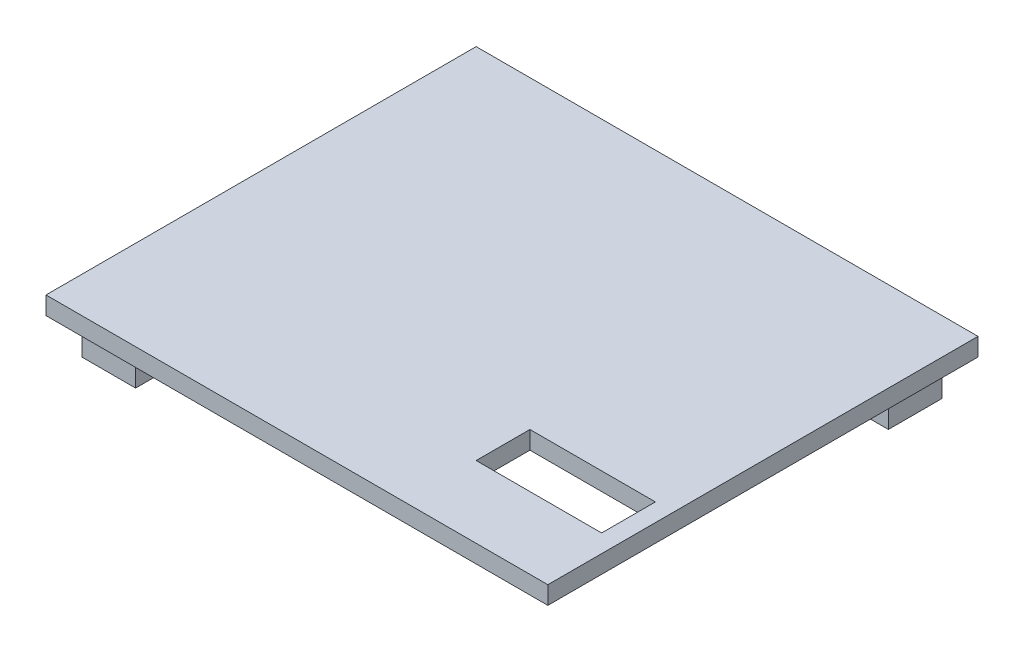
ISO-10303-21;
HEADER;
FILE_DESCRIPTION(('STEP AP214'),'2;1');
FILE_NAME('part.step','',(''),(''),'','','');
FILE_SCHEMA(('AUTOMOTIVE_DESIGN { 1 0 10303 214 1 1 1 1 }'));
ENDSEC;
DATA;
#1=APPLICATION_CONTEXT('core data for automotive mechanical design processes');
#2=APPLICATION_PROTOCOL_DEFINITION('international standard','automotive_design',2000,#1);
#3=PRODUCT_CONTEXT('',#1,'mechanical');
#4=PRODUCT('Part','Part','',(#3));
#5=PRODUCT_RELATED_PRODUCT_CATEGORY('part','',(#4));
#6=PRODUCT_DEFINITION_FORMATION('','',#4);
#7=PRODUCT_DEFINITION_CONTEXT('part definition',#1,'design');
#8=PRODUCT_DEFINITION('design','',#6,#7);
#9=PRODUCT_DEFINITION_SHAPE('','',#8);
#10=(LENGTH_UNIT() NAMED_UNIT(*) SI_UNIT(.MILLI.,.METRE.));
#11=(NAMED_UNIT(*) PLANE_ANGLE_UNIT() SI_UNIT($,.RADIAN.));
#12=(NAMED_UNIT(*) SI_UNIT($,.STERADIAN.) SOLID_ANGLE_UNIT());
#13=UNCERTAINTY_MEASURE_WITH_UNIT(LENGTH_MEASURE(1.E-05),#10,'distance_accuracy_value','');
#14=(GEOMETRIC_REPRESENTATION_CONTEXT(3) GLOBAL_UNCERTAINTY_ASSIGNED_CONTEXT((#13)) GLOBAL_UNIT_ASSIGNED_CONTEXT((#10,
#11,#12)) REPRESENTATION_CONTEXT('',''));
#15=CARTESIAN_POINT('',(0.,0.,0.));
#16=DIRECTION('',(0.,0.,1.));
#17=DIRECTION('',(1.,0.,0.));
#18=AXIS2_PLACEMENT_3D('',#15,#16,#17);
#19=CARTESIAN_POINT('',(0.,0.,0.));
#20=DIRECTION('',(0.,-1.,0.));
#21=DIRECTION('',(0.,0.,-1.));
#22=AXIS2_PLACEMENT_3D('',#19,#20,#21);
#23=PLANE('',#22);
#24=DIRECTION('',(-1.,0.,0.));
#25=VECTOR('',#24,1.);
#26=CARTESIAN_POINT('',(0.,0.,-146.05));
#27=LINE('',#26,#25);
#28=CARTESIAN_POINT('',(-152.4,0.,-146.05));
#29=VERTEX_POINT('',#28);
#30=CARTESIAN_POINT('',(-171.45,0.,-146.05));
#31=VERTEX_POINT('',#30);
#32=EDGE_CURVE('E213',#29,#31,#27,.T.);
#33=ORIENTED_EDGE('',*,*,#32,.T.);
#34=DIRECTION('',(0.,0.,1.));
#35=VECTOR('',#34,1.);
#36=CARTESIAN_POINT('',(-171.45,0.,0.));
#37=LINE('',#36,#35);
#38=CARTESIAN_POINT('',(-171.45,0.,-127.));
#39=VERTEX_POINT('',#38);
#40=EDGE_CURVE('E228',#31,#39,#37,.T.);
#41=ORIENTED_EDGE('',*,*,#40,.T.);
#42=DIRECTION('',(1.,0.,0.));
#43=VECTOR('',#42,1.);
#44=CARTESIAN_POINT('',(0.,0.,-127.));
#45=LINE('',#44,#43);
#46=CARTESIAN_POINT('',(-165.1,0.,-127.));
#47=VERTEX_POINT('',#46);
#48=EDGE_CURVE('E248',#39,#47,#45,.T.);
#49=ORIENTED_EDGE('',*,*,#48,.T.);
#50=DIRECTION('',(0.,0.,-1.));
#51=VECTOR('',#50,1.);
#52=CARTESIAN_POINT('',(-165.1,0.,0.));
#53=LINE('',#52,#51);
#54=CARTESIAN_POINT('',(-165.1,0.,-139.720102982205));
#55=VERTEX_POINT('',#54);
#56=EDGE_CURVE('E246',#47,#55,#53,.T.);
#57=ORIENTED_EDGE('',*,*,#56,.T.);
#58=DIRECTION('',(1.,0.,0.));
#59=VECTOR('',#58,1.);
#60=CARTESIAN_POINT('',(0.,0.,-139.720102982205));
#61=LINE('',#60,#59);
#62=CARTESIAN_POINT('',(-152.4,0.,-139.720102982205));
#63=VERTEX_POINT('',#62);
#64=EDGE_CURVE('E55',#55,#63,#61,.T.);
#65=ORIENTED_EDGE('',*,*,#64,.T.);
#66=DIRECTION('',(0.,0.,-1.));
#67=VECTOR('',#66,1.);
#68=CARTESIAN_POINT('',(-152.4,0.,0.));
#69=LINE('',#68,#67);
#70=EDGE_CURVE('E50',#63,#29,#69,.T.);
#71=ORIENTED_EDGE('',*,*,#70,.T.);
#72=EDGE_LOOP('',(#33,#41,#49,#57,#65,#71));
#73=FACE_BOUND('',#72,.T.);
#74=DIRECTION('',(1.,0.,0.));
#75=VECTOR('',#74,1.);
#76=CARTESIAN_POINT('',(0.,0.,0.));
#77=LINE('',#76,#75);
#78=CARTESIAN_POINT('',(-177.8,0.,0.));
#79=VERTEX_POINT('',#78);
#80=CARTESIAN_POINT('',(0.,0.,0.));
#81=VERTEX_POINT('',#80);
#82=EDGE_CURVE('E384',#79,#81,#77,.T.);
#83=ORIENTED_EDGE('',*,*,#82,.F.);
#84=DIRECTION('',(0.,0.,1.));
#85=VECTOR('',#84,1.);
#86=CARTESIAN_POINT('',(-177.8,0.,0.));
#87=LINE('',#86,#85);
#88=CARTESIAN_POINT('',(-177.8,0.,-152.4));
#89=VERTEX_POINT('',#88);
#90=EDGE_CURVE('E389',#89,#79,#87,.T.);
#91=ORIENTED_EDGE('',*,*,#90,.F.);
#92=DIRECTION('',(-1.,0.,0.));
#93=VECTOR('',#92,1.);
#94=CARTESIAN_POINT('',(0.,0.,-152.4));
#95=LINE('',#94,#93);
#96=CARTESIAN_POINT('',(0.,0.,-152.4));
#97=VERTEX_POINT('',#96);
#98=EDGE_CURVE('E400',#97,#89,#95,.T.);
#99=ORIENTED_EDGE('',*,*,#98,.F.);
#100=DIRECTION('',(0.,0.,-1.));
#101=VECTOR('',#100,1.);
#102=CARTESIAN_POINT('',(0.,0.,0.));
#103=LINE('',#102,#101);
#104=EDGE_CURVE('E398',#81,#97,#103,.T.);
#105=ORIENTED_EDGE('',*,*,#104,.F.);
#106=EDGE_LOOP('',(#83,#91,#99,#105));
#107=FACE_BOUND('',#106,.T.);
#108=DIRECTION('',(1.,0.,0.));
#109=VECTOR('',#108,1.);
#110=CARTESIAN_POINT('',(-6.35,0.,-25.4));
#111=LINE('',#110,#109);
#112=CARTESIAN_POINT('',(-50.8,0.,-25.4));
#113=VERTEX_POINT('',#112);
#114=CARTESIAN_POINT('',(-6.35,0.,-25.4));
#115=VERTEX_POINT('',#114);
#116=EDGE_CURVE('E357',#113,#115,#111,.T.);
#117=ORIENTED_EDGE('',*,*,#116,.T.);
#118=DIRECTION('',(0.,0.,-1.));
#119=VECTOR('',#118,1.);
#120=CARTESIAN_POINT('',(-6.35,0.,-44.45));
#121=LINE('',#120,#119);
#122=CARTESIAN_POINT('',(-6.35,0.,-44.45));
#123=VERTEX_POINT('',#122);
#124=EDGE_CURVE('E353',#115,#123,#121,.T.);
#125=ORIENTED_EDGE('',*,*,#124,.T.);
#126=DIRECTION('',(-1.,0.,0.));
#127=VECTOR('',#126,1.);
#128=CARTESIAN_POINT('',(-50.8,0.,-44.45));
#129=LINE('',#128,#127);
#130=CARTESIAN_POINT('',(-50.8,0.,-44.45));
#131=VERTEX_POINT('',#130);
#132=EDGE_CURVE('E367',#123,#131,#129,.T.);
#133=ORIENTED_EDGE('',*,*,#132,.T.);
#134=DIRECTION('',(0.,0.,1.));
#135=VECTOR('',#134,1.);
#136=CARTESIAN_POINT('',(-50.8,0.,-25.4));
#137=LINE('',#136,#135);
#138=EDGE_CURVE('E370',#131,#113,#137,.T.);
#139=ORIENTED_EDGE('',*,*,#138,.T.);
#140=EDGE_LOOP('',(#117,#125,#133,#139));
#141=FACE_BOUND('',#140,.T.);
#142=DIRECTION('',(1.,0.,0.));
#143=VECTOR('',#142,1.);
#144=CARTESIAN_POINT('',(0.,0.,-12.7));
#145=LINE('',#144,#143);
#146=CARTESIAN_POINT('',(-165.1,0.,-12.7));
#147=VERTEX_POINT('',#146);
#148=CARTESIAN_POINT('',(-152.4,0.,-12.7));
#149=VERTEX_POINT('',#148);
#150=EDGE_CURVE('E327',#147,#149,#145,.T.);
#151=ORIENTED_EDGE('',*,*,#150,.F.);
#152=DIRECTION('',(0.,0.,1.));
#153=VECTOR('',#152,1.);
#154=CARTESIAN_POINT('',(-165.1,0.,0.));
#155=LINE('',#154,#153);
#156=CARTESIAN_POINT('',(-165.1,0.,-25.4));
#157=VERTEX_POINT('',#156);
#158=EDGE_CURVE('E306',#157,#147,#155,.T.);
#159=ORIENTED_EDGE('',*,*,#158,.F.);
#160=DIRECTION('',(1.,0.,0.));
#161=VECTOR('',#160,1.);
#162=CARTESIAN_POINT('',(0.,0.,-25.4));
#163=LINE('',#162,#161);
#164=CARTESIAN_POINT('',(-171.45,0.,-25.4));
#165=VERTEX_POINT('',#164);
#166=EDGE_CURVE('E311',#165,#157,#163,.T.);
#167=ORIENTED_EDGE('',*,*,#166,.F.);
#168=DIRECTION('',(0.,0.,1.));
#169=VECTOR('',#168,1.);
#170=CARTESIAN_POINT('',(-171.45,0.,0.));
#171=LINE('',#170,#169);
#172=CARTESIAN_POINT('',(-171.45,0.,-6.34999999999999));
#173=VERTEX_POINT('',#172);
#174=EDGE_CURVE('E336',#165,#173,#171,.T.);
#175=ORIENTED_EDGE('',*,*,#174,.T.);
#176=DIRECTION('',(1.,0.,0.));
#177=VECTOR('',#176,1.);
#178=CARTESIAN_POINT('',(0.,0.,-6.34999999999999));
#179=LINE('',#178,#177);
#180=CARTESIAN_POINT('',(-152.4,0.,-6.34999999999999));
#181=VERTEX_POINT('',#180);
#182=EDGE_CURVE('E333',#173,#181,#179,.T.);
#183=ORIENTED_EDGE('',*,*,#182,.T.);
#184=DIRECTION('',(0.,0.,-1.));
#185=VECTOR('',#184,1.);
#186=CARTESIAN_POINT('',(-152.4,0.,0.));
#187=LINE('',#186,#185);
#188=EDGE_CURVE('E330',#181,#149,#187,.T.);
#189=ORIENTED_EDGE('',*,*,#188,.T.);
#190=EDGE_LOOP('',(#151,#159,#167,#175,#183,#189));
#191=FACE_BOUND('',#190,.T.);
#192=DIRECTION('',(0.,0.,-1.));
#193=VECTOR('',#192,1.);
#194=CARTESIAN_POINT('',(-25.4,0.,0.));
#195=LINE('',#194,#193);
#196=CARTESIAN_POINT('',(-25.4,0.,-139.720102982205));
#197=VERTEX_POINT('',#196);
#198=CARTESIAN_POINT('',(-25.4,0.,-146.05));
#199=VERTEX_POINT('',#198);
#200=EDGE_CURVE('E281',#197,#199,#195,.T.);
#201=ORIENTED_EDGE('',*,*,#200,.F.);
#202=DIRECTION('',(-1.,0.,0.));
#203=VECTOR('',#202,1.);
#204=CARTESIAN_POINT('',(0.,0.,-139.720102982205));
#205=LINE('',#204,#203);
#206=CARTESIAN_POINT('',(-12.7,0.,-139.720102982205));
#207=VERTEX_POINT('',#206);
#208=EDGE_CURVE('E216',#207,#197,#205,.T.);
#209=ORIENTED_EDGE('',*,*,#208,.F.);
#210=DIRECTION('',(0.,0.,-1.));
#211=VECTOR('',#210,1.);
#212=CARTESIAN_POINT('',(-12.7,0.,0.));
#213=LINE('',#212,#211);
#214=CARTESIAN_POINT('',(-12.7,0.,-127.));
#215=VERTEX_POINT('',#214);
#216=EDGE_CURVE('E266',#215,#207,#213,.T.);
#217=ORIENTED_EDGE('',*,*,#216,.F.);
#218=DIRECTION('',(-1.,0.,0.));
#219=VECTOR('',#218,1.);
#220=CARTESIAN_POINT('',(0.,0.,-127.));
#221=LINE('',#220,#219);
#222=CARTESIAN_POINT('',(-6.34999999999999,0.,-127.));
#223=VERTEX_POINT('',#222);
#224=EDGE_CURVE('E290',#223,#215,#221,.T.);
#225=ORIENTED_EDGE('',*,*,#224,.F.);
#226=DIRECTION('',(0.,0.,-1.));
#227=VECTOR('',#226,1.);
#228=CARTESIAN_POINT('',(-6.34999999999999,0.,0.));
#229=LINE('',#228,#227);
#230=CARTESIAN_POINT('',(-6.34999999999999,0.,-146.05));
#231=VERTEX_POINT('',#230);
#232=EDGE_CURVE('E287',#223,#231,#229,.T.);
#233=ORIENTED_EDGE('',*,*,#232,.T.);
#234=DIRECTION('',(-1.,0.,0.));
#235=VECTOR('',#234,1.);
#236=CARTESIAN_POINT('',(0.,0.,-146.05));
#237=LINE('',#236,#235);
#238=EDGE_CURVE('E284',#231,#199,#237,.T.);
#239=ORIENTED_EDGE('',*,*,#238,.T.);
#240=EDGE_LOOP('',(#201,#209,#217,#225,#233,#239));
#241=FACE_BOUND('',#240,.T.);
#242=ADVANCED_FACE('F35',(#73,#107,#141,#191,#241),#23,.T.);
#243=CARTESIAN_POINT('',(0.,6.35,0.));
#244=DIRECTION('',(0.,-1.,0.));
#245=DIRECTION('',(0.,0.,-1.));
#246=AXIS2_PLACEMENT_3D('',#243,#244,#245);
#247=PLANE('',#246);
#248=DIRECTION('',(1.,0.,0.));
#249=VECTOR('',#248,1.);
#250=CARTESIAN_POINT('',(0.,6.35,0.));
#251=LINE('',#250,#249);
#252=CARTESIAN_POINT('',(-177.8,6.35,0.));
#253=VERTEX_POINT('',#252);
#254=CARTESIAN_POINT('',(0.,6.35,0.));
#255=VERTEX_POINT('',#254);
#256=EDGE_CURVE('E385',#253,#255,#251,.T.);
#257=ORIENTED_EDGE('',*,*,#256,.T.);
#258=DIRECTION('',(0.,0.,-1.));
#259=VECTOR('',#258,1.);
#260=CARTESIAN_POINT('',(0.,6.35,0.));
#261=LINE('',#260,#259);
#262=CARTESIAN_POINT('',(0.,6.35,-152.4));
#263=VERTEX_POINT('',#262);
#264=EDGE_CURVE('E388',#255,#263,#261,.T.);
#265=ORIENTED_EDGE('',*,*,#264,.T.);
#266=DIRECTION('',(-1.,0.,0.));
#267=VECTOR('',#266,1.);
#268=CARTESIAN_POINT('',(0.,6.35,-152.4));
#269=LINE('',#268,#267);
#270=CARTESIAN_POINT('',(-177.8,6.35,-152.4));
#271=VERTEX_POINT('',#270);
#272=EDGE_CURVE('E391',#263,#271,#269,.T.);
#273=ORIENTED_EDGE('',*,*,#272,.T.);
#274=DIRECTION('',(0.,0.,1.));
#275=VECTOR('',#274,1.);
#276=CARTESIAN_POINT('',(-177.8,6.35,0.));
#277=LINE('',#276,#275);
#278=EDGE_CURVE('E393',#271,#253,#277,.T.);
#279=ORIENTED_EDGE('',*,*,#278,.T.);
#280=EDGE_LOOP('',(#257,#265,#273,#279));
#281=FACE_BOUND('',#280,.T.);
#282=DIRECTION('',(0.,0.,-1.));
#283=VECTOR('',#282,1.);
#284=CARTESIAN_POINT('',(-6.35,6.35,-44.45));
#285=LINE('',#284,#283);
#286=CARTESIAN_POINT('',(-6.35,6.35,-25.4));
#287=VERTEX_POINT('',#286);
#288=CARTESIAN_POINT('',(-6.35,6.35,-44.45));
#289=VERTEX_POINT('',#288);
#290=EDGE_CURVE('E354',#287,#289,#285,.T.);
#291=ORIENTED_EDGE('',*,*,#290,.F.);
#292=DIRECTION('',(1.,0.,0.));
#293=VECTOR('',#292,1.);
#294=CARTESIAN_POINT('',(-6.35,6.35,-25.4));
#295=LINE('',#294,#293);
#296=CARTESIAN_POINT('',(-50.8,6.35,-25.4));
#297=VERTEX_POINT('',#296);
#298=EDGE_CURVE('E362',#297,#287,#295,.T.);
#299=ORIENTED_EDGE('',*,*,#298,.F.);
#300=DIRECTION('',(0.,0.,1.));
#301=VECTOR('',#300,1.);
#302=CARTESIAN_POINT('',(-50.8,6.35,-25.4));
#303=LINE('',#302,#301);
#304=CARTESIAN_POINT('',(-50.8,6.35,-44.45));
#305=VERTEX_POINT('',#304);
#306=EDGE_CURVE('E359',#305,#297,#303,.T.);
#307=ORIENTED_EDGE('',*,*,#306,.F.);
#308=DIRECTION('',(-1.,0.,0.));
#309=VECTOR('',#308,1.);
#310=CARTESIAN_POINT('',(-50.8,6.35,-44.45));
#311=LINE('',#310,#309);
#312=EDGE_CURVE('E356',#289,#305,#311,.T.);
#313=ORIENTED_EDGE('',*,*,#312,.F.);
#314=EDGE_LOOP('',(#291,#299,#307,#313));
#315=FACE_BOUND('',#314,.T.);
#316=ADVANCED_FACE('F427',(#281,#315),#247,.F.);
#317=CARTESIAN_POINT('',(0.,6.35,0.));
#318=DIRECTION('',(0.,0.,-1.));
#319=DIRECTION('',(-1.,0.,0.));
#320=AXIS2_PLACEMENT_3D('',#317,#318,#319);
#321=PLANE('',#320);
#322=ORIENTED_EDGE('',*,*,#82,.T.);
#323=DIRECTION('',(0.,-1.,0.));
#324=VECTOR('',#323,1.);
#325=CARTESIAN_POINT('',(0.,6.35,0.));
#326=LINE('',#325,#324);
#327=EDGE_CURVE('E11',#255,#81,#326,.T.);
#328=ORIENTED_EDGE('',*,*,#327,.F.);
#329=ORIENTED_EDGE('',*,*,#256,.F.);
#330=DIRECTION('',(0.,-1.,0.));
#331=VECTOR('',#330,1.);
#332=CARTESIAN_POINT('',(-177.8,6.35,0.));
#333=LINE('',#332,#331);
#334=EDGE_CURVE('E395',#253,#79,#333,.T.);
#335=ORIENTED_EDGE('',*,*,#334,.T.);
#336=EDGE_LOOP('',(#322,#328,#329,#335));
#337=FACE_BOUND('',#336,.T.);
#338=ADVANCED_FACE('F37',(#337),#321,.F.);
#339=CARTESIAN_POINT('',(0.,6.35,0.));
#340=DIRECTION('',(-1.,0.,0.));
#341=DIRECTION('',(0.,0.,1.));
#342=AXIS2_PLACEMENT_3D('',#339,#340,#341);
#343=PLANE('',#342);
#344=ORIENTED_EDGE('',*,*,#104,.T.);
#345=DIRECTION('',(0.,-1.,0.));
#346=VECTOR('',#345,1.);
#347=CARTESIAN_POINT('',(0.,6.35,-152.4));
#348=LINE('',#347,#346);
#349=EDGE_CURVE('E43',#263,#97,#348,.T.);
#350=ORIENTED_EDGE('',*,*,#349,.F.);
#351=ORIENTED_EDGE('',*,*,#264,.F.);
#352=ORIENTED_EDGE('',*,*,#327,.T.);
#353=EDGE_LOOP('',(#344,#350,#351,#352));
#354=FACE_BOUND('',#353,.T.);
#355=ADVANCED_FACE('F429',(#354),#343,.F.);
#356=CARTESIAN_POINT('',(0.,6.35,-152.4));
#357=DIRECTION('',(0.,0.,1.));
#358=DIRECTION('',(1.,0.,0.));
#359=AXIS2_PLACEMENT_3D('',#356,#357,#358);
#360=PLANE('',#359);
#361=ORIENTED_EDGE('',*,*,#98,.T.);
#362=DIRECTION('',(0.,-1.,0.));
#363=VECTOR('',#362,1.);
#364=CARTESIAN_POINT('',(-177.8,6.35,-152.4));
#365=LINE('',#364,#363);
#366=EDGE_CURVE('E405',#271,#89,#365,.T.);
#367=ORIENTED_EDGE('',*,*,#366,.F.);
#368=ORIENTED_EDGE('',*,*,#272,.F.);
#369=ORIENTED_EDGE('',*,*,#349,.T.);
#370=EDGE_LOOP('',(#361,#367,#368,#369));
#371=FACE_BOUND('',#370,.T.);
#372=ADVANCED_FACE('F412',(#371),#360,.F.);
#373=CARTESIAN_POINT('',(-177.8,6.35,0.));
#374=DIRECTION('',(1.,0.,0.));
#375=DIRECTION('',(0.,0.,-1.));
#376=AXIS2_PLACEMENT_3D('',#373,#374,#375);
#377=PLANE('',#376);
#378=ORIENTED_EDGE('',*,*,#90,.T.);
#379=ORIENTED_EDGE('',*,*,#334,.F.);
#380=ORIENTED_EDGE('',*,*,#278,.F.);
#381=ORIENTED_EDGE('',*,*,#366,.T.);
#382=EDGE_LOOP('',(#378,#379,#380,#381));
#383=FACE_BOUND('',#382,.T.);
#384=ADVANCED_FACE('F421',(#383),#377,.F.);
#385=CARTESIAN_POINT('',(-6.35,6.35,-44.45));
#386=DIRECTION('',(-1.,0.,0.));
#387=DIRECTION('',(0.,0.,1.));
#388=AXIS2_PLACEMENT_3D('',#385,#386,#387);
#389=PLANE('',#388);
#390=ORIENTED_EDGE('',*,*,#124,.F.);
#391=DIRECTION('',(0.,-1.,0.));
#392=VECTOR('',#391,1.);
#393=CARTESIAN_POINT('',(-6.35,6.35,-25.4));
#394=LINE('',#393,#392);
#395=EDGE_CURVE('E364',#287,#115,#394,.T.);
#396=ORIENTED_EDGE('',*,*,#395,.F.);
#397=ORIENTED_EDGE('',*,*,#290,.T.);
#398=DIRECTION('',(0.,-1.,0.));
#399=VECTOR('',#398,1.);
#400=CARTESIAN_POINT('',(-6.35,6.35,-44.45));
#401=LINE('',#400,#399);
#402=EDGE_CURVE('E381',#289,#123,#401,.T.);
#403=ORIENTED_EDGE('',*,*,#402,.T.);
#404=EDGE_LOOP('',(#390,#396,#397,#403));
#405=FACE_BOUND('',#404,.T.);
#406=ADVANCED_FACE('F445',(#405),#389,.T.);
#407=CARTESIAN_POINT('',(-50.8,6.35,-44.45));
#408=DIRECTION('',(0.,0.,1.));
#409=DIRECTION('',(1.,0.,0.));
#410=AXIS2_PLACEMENT_3D('',#407,#408,#409);
#411=PLANE('',#410);
#412=ORIENTED_EDGE('',*,*,#132,.F.);
#413=ORIENTED_EDGE('',*,*,#402,.F.);
#414=ORIENTED_EDGE('',*,*,#312,.T.);
#415=DIRECTION('',(0.,-1.,0.));
#416=VECTOR('',#415,1.);
#417=CARTESIAN_POINT('',(-50.8,6.35,-44.45));
#418=LINE('',#417,#416);
#419=EDGE_CURVE('E379',#305,#131,#418,.T.);
#420=ORIENTED_EDGE('',*,*,#419,.T.);
#421=EDGE_LOOP('',(#412,#413,#414,#420));
#422=FACE_BOUND('',#421,.T.);
#423=ADVANCED_FACE('F449',(#422),#411,.T.);
#424=CARTESIAN_POINT('',(-50.8,6.35,-25.4));
#425=DIRECTION('',(1.,0.,0.));
#426=DIRECTION('',(0.,0.,-1.));
#427=AXIS2_PLACEMENT_3D('',#424,#425,#426);
#428=PLANE('',#427);
#429=ORIENTED_EDGE('',*,*,#138,.F.);
#430=ORIENTED_EDGE('',*,*,#419,.F.);
#431=ORIENTED_EDGE('',*,*,#306,.T.);
#432=DIRECTION('',(0.,-1.,0.));
#433=VECTOR('',#432,1.);
#434=CARTESIAN_POINT('',(-50.8,6.35,-25.4));
#435=LINE('',#434,#433);
#436=EDGE_CURVE('E377',#297,#113,#435,.T.);
#437=ORIENTED_EDGE('',*,*,#436,.T.);
#438=EDGE_LOOP('',(#429,#430,#431,#437));
#439=FACE_BOUND('',#438,.T.);
#440=ADVANCED_FACE('F454',(#439),#428,.T.);
#441=CARTESIAN_POINT('',(-6.35,6.35,-25.4));
#442=DIRECTION('',(0.,0.,-1.));
#443=DIRECTION('',(-1.,0.,0.));
#444=AXIS2_PLACEMENT_3D('',#441,#442,#443);
#445=PLANE('',#444);
#446=ORIENTED_EDGE('',*,*,#116,.F.);
#447=ORIENTED_EDGE('',*,*,#436,.F.);
#448=ORIENTED_EDGE('',*,*,#298,.T.);
#449=ORIENTED_EDGE('',*,*,#395,.T.);
#450=EDGE_LOOP('',(#446,#447,#448,#449));
#451=FACE_BOUND('',#450,.T.);
#452=ADVANCED_FACE('F460',(#451),#445,.T.);
#453=CARTESIAN_POINT('',(-165.1,-12.7,0.));
#454=DIRECTION('',(-1.,0.,0.));
#455=DIRECTION('',(0.,0.,1.));
#456=AXIS2_PLACEMENT_3D('',#453,#454,#455);
#457=PLANE('',#456);
#458=ORIENTED_EDGE('',*,*,#158,.T.);
#459=DIRECTION('',(0.,1.,0.));
#460=VECTOR('',#459,1.);
#461=CARTESIAN_POINT('',(-165.1,-12.7,-12.7));
#462=LINE('',#461,#460);
#463=CARTESIAN_POINT('',(-165.1,-12.7,-12.7));
#464=VERTEX_POINT('',#463);
#465=EDGE_CURVE('E351',#464,#147,#462,.T.);
#466=ORIENTED_EDGE('',*,*,#465,.F.);
#467=DIRECTION('',(0.,0.,1.));
#468=VECTOR('',#467,1.);
#469=CARTESIAN_POINT('',(-165.1,-12.7,0.));
#470=LINE('',#469,#468);
#471=CARTESIAN_POINT('',(-165.1,-12.7,-25.4));
#472=VERTEX_POINT('',#471);
#473=EDGE_CURVE('E307',#472,#464,#470,.T.);
#474=ORIENTED_EDGE('',*,*,#473,.F.);
#475=DIRECTION('',(0.,1.,0.));
#476=VECTOR('',#475,1.);
#477=CARTESIAN_POINT('',(-165.1,-12.7,-25.4));
#478=LINE('',#477,#476);
#479=EDGE_CURVE('E324',#472,#157,#478,.T.);
#480=ORIENTED_EDGE('',*,*,#479,.T.);
#481=EDGE_LOOP('',(#458,#466,#474,#480));
#482=FACE_BOUND('',#481,.T.);
#483=ADVANCED_FACE('F464',(#482),#457,.F.);
#484=CARTESIAN_POINT('',(0.,-12.7,-12.7));
#485=DIRECTION('',(0.,0.,1.));
#486=DIRECTION('',(1.,0.,0.));
#487=AXIS2_PLACEMENT_3D('',#484,#485,#486);
#488=PLANE('',#487);
#489=ORIENTED_EDGE('',*,*,#150,.T.);
#490=DIRECTION('',(0.,1.,0.));
#491=VECTOR('',#490,1.);
#492=CARTESIAN_POINT('',(-152.4,-12.7,-12.7));
#493=LINE('',#492,#491);
#494=CARTESIAN_POINT('',(-152.4,-12.7,-12.7));
#495=VERTEX_POINT('',#494);
#496=EDGE_CURVE('E349',#495,#149,#493,.T.);
#497=ORIENTED_EDGE('',*,*,#496,.F.);
#498=DIRECTION('',(1.,0.,0.));
#499=VECTOR('',#498,1.);
#500=CARTESIAN_POINT('',(0.,-12.7,-12.7));
#501=LINE('',#500,#499);
#502=EDGE_CURVE('E310',#464,#495,#501,.T.);
#503=ORIENTED_EDGE('',*,*,#502,.F.);
#504=ORIENTED_EDGE('',*,*,#465,.T.);
#505=EDGE_LOOP('',(#489,#497,#503,#504));
#506=FACE_BOUND('',#505,.T.);
#507=ADVANCED_FACE('F468',(#506),#488,.F.);
#508=CARTESIAN_POINT('',(-152.4,-12.7,0.));
#509=DIRECTION('',(1.,0.,0.));
#510=DIRECTION('',(0.,0.,-1.));
#511=AXIS2_PLACEMENT_3D('',#508,#509,#510);
#512=PLANE('',#511);
#513=ORIENTED_EDGE('',*,*,#188,.F.);
#514=DIRECTION('',(0.,1.,0.));
#515=VECTOR('',#514,1.);
#516=CARTESIAN_POINT('',(-152.4,-12.7,-6.34999999999999));
#517=LINE('',#516,#515);
#518=CARTESIAN_POINT('',(-152.4,-12.7,-6.34999999999999));
#519=VERTEX_POINT('',#518);
#520=EDGE_CURVE('E347',#519,#181,#517,.T.);
#521=ORIENTED_EDGE('',*,*,#520,.F.);
#522=DIRECTION('',(0.,0.,-1.));
#523=VECTOR('',#522,1.);
#524=CARTESIAN_POINT('',(-152.4,-12.7,0.));
#525=LINE('',#524,#523);
#526=EDGE_CURVE('E313',#519,#495,#525,.T.);
#527=ORIENTED_EDGE('',*,*,#526,.T.);
#528=ORIENTED_EDGE('',*,*,#496,.T.);
#529=EDGE_LOOP('',(#513,#521,#527,#528));
#530=FACE_BOUND('',#529,.T.);
#531=ADVANCED_FACE('F472',(#530),#512,.T.);
#532=CARTESIAN_POINT('',(0.,-12.7,-6.34999999999999));
#533=DIRECTION('',(0.,0.,1.));
#534=DIRECTION('',(1.,0.,0.));
#535=AXIS2_PLACEMENT_3D('',#532,#533,#534);
#536=PLANE('',#535);
#537=ORIENTED_EDGE('',*,*,#182,.F.);
#538=DIRECTION('',(0.,1.,0.));
#539=VECTOR('',#538,1.);
#540=CARTESIAN_POINT('',(-171.45,-12.7,-6.34999999999999));
#541=LINE('',#540,#539);
#542=CARTESIAN_POINT('',(-171.45,-12.7,-6.34999999999999));
#543=VERTEX_POINT('',#542);
#544=EDGE_CURVE('E345',#543,#173,#541,.T.);
#545=ORIENTED_EDGE('',*,*,#544,.F.);
#546=DIRECTION('',(1.,0.,0.));
#547=VECTOR('',#546,1.);
#548=CARTESIAN_POINT('',(0.,-12.7,-6.34999999999999));
#549=LINE('',#548,#547);
#550=EDGE_CURVE('E316',#543,#519,#549,.T.);
#551=ORIENTED_EDGE('',*,*,#550,.T.);
#552=ORIENTED_EDGE('',*,*,#520,.T.);
#553=EDGE_LOOP('',(#537,#545,#551,#552));
#554=FACE_BOUND('',#553,.T.);
#555=ADVANCED_FACE('F476',(#554),#536,.T.);
#556=CARTESIAN_POINT('',(-171.45,-12.7,0.));
#557=DIRECTION('',(-1.,0.,0.));
#558=DIRECTION('',(0.,0.,1.));
#559=AXIS2_PLACEMENT_3D('',#556,#557,#558);
#560=PLANE('',#559);
#561=ORIENTED_EDGE('',*,*,#174,.F.);
#562=DIRECTION('',(0.,1.,0.));
#563=VECTOR('',#562,1.);
#564=CARTESIAN_POINT('',(-171.45,-12.7,-25.4));
#565=LINE('',#564,#563);
#566=CARTESIAN_POINT('',(-171.45,-12.7,-25.4));
#567=VERTEX_POINT('',#566);
#568=EDGE_CURVE('E342',#567,#165,#565,.T.);
#569=ORIENTED_EDGE('',*,*,#568,.F.);
#570=DIRECTION('',(0.,0.,1.));
#571=VECTOR('',#570,1.);
#572=CARTESIAN_POINT('',(-171.45,-12.7,0.));
#573=LINE('',#572,#571);
#574=EDGE_CURVE('E319',#567,#543,#573,.T.);
#575=ORIENTED_EDGE('',*,*,#574,.T.);
#576=ORIENTED_EDGE('',*,*,#544,.T.);
#577=EDGE_LOOP('',(#561,#569,#575,#576));
#578=FACE_BOUND('',#577,.T.);
#579=ADVANCED_FACE('F480',(#578),#560,.T.);
#580=CARTESIAN_POINT('',(0.,-12.7,-25.4));
#581=DIRECTION('',(0.,0.,1.));
#582=DIRECTION('',(1.,0.,0.));
#583=AXIS2_PLACEMENT_3D('',#580,#581,#582);
#584=PLANE('',#583);
#585=ORIENTED_EDGE('',*,*,#166,.T.);
#586=ORIENTED_EDGE('',*,*,#479,.F.);
#587=DIRECTION('',(1.,0.,0.));
#588=VECTOR('',#587,1.);
#589=CARTESIAN_POINT('',(0.,-12.7,-25.4));
#590=LINE('',#589,#588);
#591=EDGE_CURVE('E322',#567,#472,#590,.T.);
#592=ORIENTED_EDGE('',*,*,#591,.F.);
#593=ORIENTED_EDGE('',*,*,#568,.T.);
#594=EDGE_LOOP('',(#585,#586,#592,#593));
#595=FACE_BOUND('',#594,.T.);
#596=ADVANCED_FACE('F484',(#595),#584,.F.);
#597=CARTESIAN_POINT('',(0.,-12.7,0.));
#598=DIRECTION('',(0.,-1.,0.));
#599=DIRECTION('',(0.,0.,-1.));
#600=AXIS2_PLACEMENT_3D('',#597,#598,#599);
#601=PLANE('',#600);
#602=ORIENTED_EDGE('',*,*,#473,.T.);
#603=ORIENTED_EDGE('',*,*,#502,.T.);
#604=ORIENTED_EDGE('',*,*,#526,.F.);
#605=ORIENTED_EDGE('',*,*,#550,.F.);
#606=ORIENTED_EDGE('',*,*,#574,.F.);
#607=ORIENTED_EDGE('',*,*,#591,.T.);
#608=EDGE_LOOP('',(#602,#603,#604,#605,#606,#607));
#609=FACE_BOUND('',#608,.T.);
#610=ADVANCED_FACE('F488',(#609),#601,.T.);
#611=CARTESIAN_POINT('',(0.,-12.7,-139.720102982205));
#612=DIRECTION('',(0.,0.,-1.));
#613=DIRECTION('',(-1.,0.,0.));
#614=AXIS2_PLACEMENT_3D('',#611,#612,#613);
#615=PLANE('',#614);
#616=ORIENTED_EDGE('',*,*,#208,.T.);
#617=DIRECTION('',(0.,1.,0.));
#618=VECTOR('',#617,1.);
#619=CARTESIAN_POINT('',(-25.4,-12.7,-139.720102982205));
#620=LINE('',#619,#618);
#621=CARTESIAN_POINT('',(-25.4,-12.7,-139.720102982205));
#622=VERTEX_POINT('',#621);
#623=EDGE_CURVE('E304',#622,#197,#620,.T.);
#624=ORIENTED_EDGE('',*,*,#623,.F.);
#625=DIRECTION('',(-1.,0.,0.));
#626=VECTOR('',#625,1.);
#627=CARTESIAN_POINT('',(0.,-12.7,-139.720102982205));
#628=LINE('',#627,#626);
#629=CARTESIAN_POINT('',(-12.7,-12.7,-139.720102982205));
#630=VERTEX_POINT('',#629);
#631=EDGE_CURVE('E262',#630,#622,#628,.T.);
#632=ORIENTED_EDGE('',*,*,#631,.F.);
#633=DIRECTION('',(0.,1.,0.));
#634=VECTOR('',#633,1.);
#635=CARTESIAN_POINT('',(-12.7,-12.7,-139.720102982205));
#636=LINE('',#635,#634);
#637=EDGE_CURVE('E278',#630,#207,#636,.T.);
#638=ORIENTED_EDGE('',*,*,#637,.T.);
#639=EDGE_LOOP('',(#616,#624,#632,#638));
#640=FACE_BOUND('',#639,.T.);
#641=ADVANCED_FACE('F492',(#640),#615,.F.);
#642=CARTESIAN_POINT('',(-25.4,-12.7,0.));
#643=DIRECTION('',(1.,0.,0.));
#644=DIRECTION('',(0.,0.,-1.));
#645=AXIS2_PLACEMENT_3D('',#642,#643,#644);
#646=PLANE('',#645);
#647=ORIENTED_EDGE('',*,*,#200,.T.);
#648=DIRECTION('',(0.,1.,0.));
#649=VECTOR('',#648,1.);
#650=CARTESIAN_POINT('',(-25.4,-12.7,-146.05));
#651=LINE('',#650,#649);
#652=CARTESIAN_POINT('',(-25.4,-12.7,-146.05));
#653=VERTEX_POINT('',#652);
#654=EDGE_CURVE('E302',#653,#199,#651,.T.);
#655=ORIENTED_EDGE('',*,*,#654,.F.);
#656=DIRECTION('',(0.,0.,-1.));
#657=VECTOR('',#656,1.);
#658=CARTESIAN_POINT('',(-25.4,-12.7,0.));
#659=LINE('',#658,#657);
#660=EDGE_CURVE('E265',#622,#653,#659,.T.);
#661=ORIENTED_EDGE('',*,*,#660,.F.);
#662=ORIENTED_EDGE('',*,*,#623,.T.);
#663=EDGE_LOOP('',(#647,#655,#661,#662));
#664=FACE_BOUND('',#663,.T.);
#665=ADVANCED_FACE('F496',(#664),#646,.F.);
#666=CARTESIAN_POINT('',(0.,-12.7,-146.05));
#667=DIRECTION('',(0.,0.,-1.));
#668=DIRECTION('',(-1.,0.,0.));
#669=AXIS2_PLACEMENT_3D('',#666,#667,#668);
#670=PLANE('',#669);
#671=ORIENTED_EDGE('',*,*,#238,.F.);
#672=DIRECTION('',(0.,1.,0.));
#673=VECTOR('',#672,1.);
#674=CARTESIAN_POINT('',(-6.34999999999999,-12.7,-146.05));
#675=LINE('',#674,#673);
#676=CARTESIAN_POINT('',(-6.34999999999999,-12.7,-146.05));
#677=VERTEX_POINT('',#676);
#678=EDGE_CURVE('E300',#677,#231,#675,.T.);
#679=ORIENTED_EDGE('',*,*,#678,.F.);
#680=DIRECTION('',(-1.,0.,0.));
#681=VECTOR('',#680,1.);
#682=CARTESIAN_POINT('',(0.,-12.7,-146.05));
#683=LINE('',#682,#681);
#684=EDGE_CURVE('E268',#677,#653,#683,.T.);
#685=ORIENTED_EDGE('',*,*,#684,.T.);
#686=ORIENTED_EDGE('',*,*,#654,.T.);
#687=EDGE_LOOP('',(#671,#679,#685,#686));
#688=FACE_BOUND('',#687,.T.);
#689=ADVANCED_FACE('F500',(#688),#670,.T.);
#690=CARTESIAN_POINT('',(-6.34999999999999,-12.7,0.));
#691=DIRECTION('',(1.,0.,0.));
#692=DIRECTION('',(0.,0.,-1.));
#693=AXIS2_PLACEMENT_3D('',#690,#691,#692);
#694=PLANE('',#693);
#695=ORIENTED_EDGE('',*,*,#232,.F.);
#696=DIRECTION('',(0.,1.,0.));
#697=VECTOR('',#696,1.);
#698=CARTESIAN_POINT('',(-6.34999999999999,-12.7,-127.));
#699=LINE('',#698,#697);
#700=CARTESIAN_POINT('',(-6.34999999999999,-12.7,-127.));
#701=VERTEX_POINT('',#700);
#702=EDGE_CURVE('E298',#701,#223,#699,.T.);
#703=ORIENTED_EDGE('',*,*,#702,.F.);
#704=DIRECTION('',(0.,0.,-1.));
#705=VECTOR('',#704,1.);
#706=CARTESIAN_POINT('',(-6.34999999999999,-12.7,0.));
#707=LINE('',#706,#705);
#708=EDGE_CURVE('E271',#701,#677,#707,.T.);
#709=ORIENTED_EDGE('',*,*,#708,.T.);
#710=ORIENTED_EDGE('',*,*,#678,.T.);
#711=EDGE_LOOP('',(#695,#703,#709,#710));
#712=FACE_BOUND('',#711,.T.);
#713=ADVANCED_FACE('F504',(#712),#694,.T.);
#714=CARTESIAN_POINT('',(0.,-12.7,-127.));
#715=DIRECTION('',(0.,0.,-1.));
#716=DIRECTION('',(-1.,0.,0.));
#717=AXIS2_PLACEMENT_3D('',#714,#715,#716);
#718=PLANE('',#717);
#719=ORIENTED_EDGE('',*,*,#224,.T.);
#720=DIRECTION('',(0.,1.,0.));
#721=VECTOR('',#720,1.);
#722=CARTESIAN_POINT('',(-12.7,-12.7,-127.));
#723=LINE('',#722,#721);
#724=CARTESIAN_POINT('',(-12.7,-12.7,-127.));
#725=VERTEX_POINT('',#724);
#726=EDGE_CURVE('E296',#725,#215,#723,.T.);
#727=ORIENTED_EDGE('',*,*,#726,.F.);
#728=DIRECTION('',(-1.,0.,0.));
#729=VECTOR('',#728,1.);
#730=CARTESIAN_POINT('',(0.,-12.7,-127.));
#731=LINE('',#730,#729);
#732=EDGE_CURVE('E274',#701,#725,#731,.T.);
#733=ORIENTED_EDGE('',*,*,#732,.F.);
#734=ORIENTED_EDGE('',*,*,#702,.T.);
#735=EDGE_LOOP('',(#719,#727,#733,#734));
#736=FACE_BOUND('',#735,.T.);
#737=ADVANCED_FACE('F508',(#736),#718,.F.);
#738=CARTESIAN_POINT('',(-12.7,-12.7,0.));
#739=DIRECTION('',(1.,0.,0.));
#740=DIRECTION('',(0.,0.,-1.));
#741=AXIS2_PLACEMENT_3D('',#738,#739,#740);
#742=PLANE('',#741);
#743=ORIENTED_EDGE('',*,*,#216,.T.);
#744=ORIENTED_EDGE('',*,*,#637,.F.);
#745=DIRECTION('',(0.,0.,-1.));
#746=VECTOR('',#745,1.);
#747=CARTESIAN_POINT('',(-12.7,-12.7,0.));
#748=LINE('',#747,#746);
#749=EDGE_CURVE('E276',#725,#630,#748,.T.);
#750=ORIENTED_EDGE('',*,*,#749,.F.);
#751=ORIENTED_EDGE('',*,*,#726,.T.);
#752=EDGE_LOOP('',(#743,#744,#750,#751));
#753=FACE_BOUND('',#752,.T.);
#754=ADVANCED_FACE('F512',(#753),#742,.F.);
#755=CARTESIAN_POINT('',(0.,-12.7,0.));
#756=DIRECTION('',(0.,-1.,0.));
#757=DIRECTION('',(0.,0.,-1.));
#758=AXIS2_PLACEMENT_3D('',#755,#756,#757);
#759=PLANE('',#758);
#760=ORIENTED_EDGE('',*,*,#631,.T.);
#761=ORIENTED_EDGE('',*,*,#660,.T.);
#762=ORIENTED_EDGE('',*,*,#684,.F.);
#763=ORIENTED_EDGE('',*,*,#708,.F.);
#764=ORIENTED_EDGE('',*,*,#732,.T.);
#765=ORIENTED_EDGE('',*,*,#749,.T.);
#766=EDGE_LOOP('',(#760,#761,#762,#763,#764,#765));
#767=FACE_BOUND('',#766,.T.);
#768=ADVANCED_FACE('F516',(#767),#759,.T.);
#769=CARTESIAN_POINT('',(0.,-12.7,-146.05));
#770=DIRECTION('',(0.,0.,-1.));
#771=DIRECTION('',(-1.,0.,0.));
#772=AXIS2_PLACEMENT_3D('',#769,#770,#771);
#773=PLANE('',#772);
#774=ORIENTED_EDGE('',*,*,#32,.F.);
#775=DIRECTION('',(0.,1.,0.));
#776=VECTOR('',#775,1.);
#777=CARTESIAN_POINT('',(-152.4,-12.7,-146.05));
#778=LINE('',#777,#776);
#779=CARTESIAN_POINT('',(-152.4,-12.7,-146.05));
#780=VERTEX_POINT('',#779);
#781=EDGE_CURVE('E207',#780,#29,#778,.T.);
#782=ORIENTED_EDGE('',*,*,#781,.F.);
#783=DIRECTION('',(-1.,0.,0.));
#784=VECTOR('',#783,1.);
#785=CARTESIAN_POINT('',(0.,-12.7,-146.05));
#786=LINE('',#785,#784);
#787=CARTESIAN_POINT('',(-171.45,-12.7,-146.05));
#788=VERTEX_POINT('',#787);
#789=EDGE_CURVE('E211',#780,#788,#786,.T.);
#790=ORIENTED_EDGE('',*,*,#789,.T.);
#791=DIRECTION('',(0.,1.,0.));
#792=VECTOR('',#791,1.);
#793=CARTESIAN_POINT('',(-171.45,-12.7,-146.05));
#794=LINE('',#793,#792);
#795=EDGE_CURVE('E242',#788,#31,#794,.T.);
#796=ORIENTED_EDGE('',*,*,#795,.T.);
#797=EDGE_LOOP('',(#774,#782,#790,#796));
#798=FACE_BOUND('',#797,.T.);
#799=ADVANCED_FACE('F209',(#798),#773,.T.);
#800=CARTESIAN_POINT('',(-152.4,-12.7,0.));
#801=DIRECTION('',(1.,0.,0.));
#802=DIRECTION('',(0.,0.,-1.));
#803=AXIS2_PLACEMENT_3D('',#800,#801,#802);
#804=PLANE('',#803);
#805=ORIENTED_EDGE('',*,*,#70,.F.);
#806=DIRECTION('',(0.,1.,0.));
#807=VECTOR('',#806,1.);
#808=CARTESIAN_POINT('',(-152.4,-12.7,-139.720102982205));
#809=LINE('',#808,#807);
#810=CARTESIAN_POINT('',(-152.4,-12.7,-139.720102982205));
#811=VERTEX_POINT('',#810);
#812=EDGE_CURVE('E217',#811,#63,#809,.T.);
#813=ORIENTED_EDGE('',*,*,#812,.F.);
#814=DIRECTION('',(0.,0.,-1.));
#815=VECTOR('',#814,1.);
#816=CARTESIAN_POINT('',(-152.4,-12.7,0.));
#817=LINE('',#816,#815);
#818=EDGE_CURVE('E223',#811,#780,#817,.T.);
#819=ORIENTED_EDGE('',*,*,#818,.T.);
#820=ORIENTED_EDGE('',*,*,#781,.T.);
#821=EDGE_LOOP('',(#805,#813,#819,#820));
#822=FACE_BOUND('',#821,.T.);
#823=ADVANCED_FACE('F230',(#822),#804,.T.);
#824=CARTESIAN_POINT('',(0.,-12.7,-139.720102982205));
#825=DIRECTION('',(0.,0.,1.));
#826=DIRECTION('',(1.,0.,0.));
#827=AXIS2_PLACEMENT_3D('',#824,#825,#826);
#828=PLANE('',#827);
#829=ORIENTED_EDGE('',*,*,#64,.F.);
#830=DIRECTION('',(0.,1.,0.));
#831=VECTOR('',#830,1.);
#832=CARTESIAN_POINT('',(-165.1,-12.7,-139.720102982205));
#833=LINE('',#832,#831);
#834=CARTESIAN_POINT('',(-165.1,-12.7,-139.720102982205));
#835=VERTEX_POINT('',#834);
#836=EDGE_CURVE('E258',#835,#55,#833,.T.);
#837=ORIENTED_EDGE('',*,*,#836,.F.);
#838=DIRECTION('',(1.,0.,0.));
#839=VECTOR('',#838,1.);
#840=CARTESIAN_POINT('',(0.,-12.7,-139.720102982205));
#841=LINE('',#840,#839);
#842=EDGE_CURVE('E231',#835,#811,#841,.T.);
#843=ORIENTED_EDGE('',*,*,#842,.T.);
#844=ORIENTED_EDGE('',*,*,#812,.T.);
#845=EDGE_LOOP('',(#829,#837,#843,#844));
#846=FACE_BOUND('',#845,.T.);
#847=ADVANCED_FACE('F525',(#846),#828,.T.);
#848=CARTESIAN_POINT('',(-165.1,-12.7,0.));
#849=DIRECTION('',(1.,0.,0.));
#850=DIRECTION('',(0.,0.,-1.));
#851=AXIS2_PLACEMENT_3D('',#848,#849,#850);
#852=PLANE('',#851);
#853=ORIENTED_EDGE('',*,*,#56,.F.);
#854=DIRECTION('',(0.,1.,0.));
#855=VECTOR('',#854,1.);
#856=CARTESIAN_POINT('',(-165.1,-12.7,-127.));
#857=LINE('',#856,#855);
#858=CARTESIAN_POINT('',(-165.1,-12.7,-127.));
#859=VERTEX_POINT('',#858);
#860=EDGE_CURVE('E255',#859,#47,#857,.T.);
#861=ORIENTED_EDGE('',*,*,#860,.F.);
#862=DIRECTION('',(0.,0.,-1.));
#863=VECTOR('',#862,1.);
#864=CARTESIAN_POINT('',(-165.1,-12.7,0.));
#865=LINE('',#864,#863);
#866=EDGE_CURVE('E233',#859,#835,#865,.T.);
#867=ORIENTED_EDGE('',*,*,#866,.T.);
#868=ORIENTED_EDGE('',*,*,#836,.T.);
#869=EDGE_LOOP('',(#853,#861,#867,#868));
#870=FACE_BOUND('',#869,.T.);
#871=ADVANCED_FACE('F528',(#870),#852,.T.);
#872=CARTESIAN_POINT('',(0.,-12.7,-127.));
#873=DIRECTION('',(0.,0.,1.));
#874=DIRECTION('',(1.,0.,0.));
#875=AXIS2_PLACEMENT_3D('',#872,#873,#874);
#876=PLANE('',#875);
#877=ORIENTED_EDGE('',*,*,#48,.F.);
#878=DIRECTION('',(0.,1.,0.));
#879=VECTOR('',#878,1.);
#880=CARTESIAN_POINT('',(-171.45,-12.7,-127.));
#881=LINE('',#880,#879);
#882=CARTESIAN_POINT('',(-171.45,-12.7,-127.));
#883=VERTEX_POINT('',#882);
#884=EDGE_CURVE('E252',#883,#39,#881,.T.);
#885=ORIENTED_EDGE('',*,*,#884,.F.);
#886=DIRECTION('',(1.,0.,0.));
#887=VECTOR('',#886,1.);
#888=CARTESIAN_POINT('',(0.,-12.7,-127.));
#889=LINE('',#888,#887);
#890=EDGE_CURVE('E238',#883,#859,#889,.T.);
#891=ORIENTED_EDGE('',*,*,#890,.T.);
#892=ORIENTED_EDGE('',*,*,#860,.T.);
#893=EDGE_LOOP('',(#877,#885,#891,#892));
#894=FACE_BOUND('',#893,.T.);
#895=ADVANCED_FACE('F532',(#894),#876,.T.);
#896=CARTESIAN_POINT('',(-171.45,-12.7,0.));
#897=DIRECTION('',(-1.,0.,0.));
#898=DIRECTION('',(0.,0.,1.));
#899=AXIS2_PLACEMENT_3D('',#896,#897,#898);
#900=PLANE('',#899);
#901=ORIENTED_EDGE('',*,*,#40,.F.);
#902=ORIENTED_EDGE('',*,*,#795,.F.);
#903=DIRECTION('',(0.,0.,1.));
#904=VECTOR('',#903,1.);
#905=CARTESIAN_POINT('',(-171.45,-12.7,0.));
#906=LINE('',#905,#904);
#907=EDGE_CURVE('E227',#788,#883,#906,.T.);
#908=ORIENTED_EDGE('',*,*,#907,.T.);
#909=ORIENTED_EDGE('',*,*,#884,.T.);
#910=EDGE_LOOP('',(#901,#902,#908,#909));
#911=FACE_BOUND('',#910,.T.);
#912=ADVANCED_FACE('F536',(#911),#900,.T.);
#913=CARTESIAN_POINT('',(0.,-12.7,0.));
#914=DIRECTION('',(0.,-1.,0.));
#915=DIRECTION('',(0.,0.,-1.));
#916=AXIS2_PLACEMENT_3D('',#913,#914,#915);
#917=PLANE('',#916);
#918=ORIENTED_EDGE('',*,*,#789,.F.);
#919=ORIENTED_EDGE('',*,*,#818,.F.);
#920=ORIENTED_EDGE('',*,*,#842,.F.);
#921=ORIENTED_EDGE('',*,*,#866,.F.);
#922=ORIENTED_EDGE('',*,*,#890,.F.);
#923=ORIENTED_EDGE('',*,*,#907,.F.);
#924=EDGE_LOOP('',(#918,#919,#920,#921,#922,#923));
#925=FACE_BOUND('',#924,.T.);
#926=ADVANCED_FACE('F221',(#925),#917,.T.);
#927=CLOSED_SHELL('',(#242,#316,#338,#355,#372,#384,#406,#423,#440,#452,#483,#507,#531,#555,
#579,#596,#610,#641,#665,#689,#713,#737,#754,#768,#799,#823,#847,#871,#895,#912,#926));
#928=MANIFOLD_SOLID_BREP('B2',#927);
#929=ADVANCED_BREP_SHAPE_REPRESENTATION('',(#18,#928),#14);
#930=SHAPE_DEFINITION_REPRESENTATION(#9,#929);
ENDSEC;
END-ISO-10303-21;
